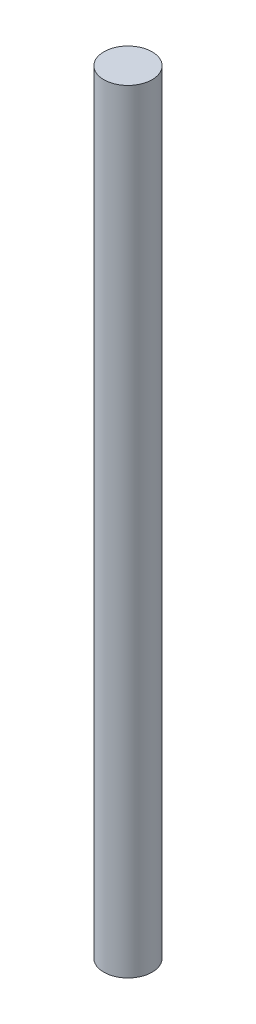
ISO-10303-21;
HEADER;
FILE_DESCRIPTION(('STEP AP214'),'2;1');
FILE_NAME('part.step','',(''),(''),'','','');
FILE_SCHEMA(('AUTOMOTIVE_DESIGN { 1 0 10303 214 1 1 1 1 }'));
ENDSEC;
DATA;
#1=APPLICATION_CONTEXT('core data for automotive mechanical design processes');
#2=APPLICATION_PROTOCOL_DEFINITION('international standard','automotive_design',2000,#1);
#3=PRODUCT_CONTEXT('',#1,'mechanical');
#4=PRODUCT('Part','Part','',(#3));
#5=PRODUCT_RELATED_PRODUCT_CATEGORY('part','',(#4));
#6=PRODUCT_DEFINITION_FORMATION('','',#4);
#7=PRODUCT_DEFINITION_CONTEXT('part definition',#1,'design');
#8=PRODUCT_DEFINITION('design','',#6,#7);
#9=PRODUCT_DEFINITION_SHAPE('','',#8);
#10=(LENGTH_UNIT() NAMED_UNIT(*) SI_UNIT(.MILLI.,.METRE.));
#11=(NAMED_UNIT(*) PLANE_ANGLE_UNIT() SI_UNIT($,.RADIAN.));
#12=(NAMED_UNIT(*) SI_UNIT($,.STERADIAN.) SOLID_ANGLE_UNIT());
#13=UNCERTAINTY_MEASURE_WITH_UNIT(LENGTH_MEASURE(1.E-05),#10,'distance_accuracy_value','');
#14=(GEOMETRIC_REPRESENTATION_CONTEXT(3) GLOBAL_UNCERTAINTY_ASSIGNED_CONTEXT((#13)) GLOBAL_UNIT_ASSIGNED_CONTEXT((#10,
#11,#12)) REPRESENTATION_CONTEXT('',''));
#15=CARTESIAN_POINT('',(0.,0.,0.));
#16=DIRECTION('',(0.,0.,1.));
#17=DIRECTION('',(1.,0.,0.));
#18=AXIS2_PLACEMENT_3D('',#15,#16,#17);
#19=CARTESIAN_POINT('',(0.,152.4,0.));
#20=DIRECTION('',(0.,-1.,0.));
#21=DIRECTION('',(0.,0.,-1.));
#22=AXIS2_PLACEMENT_3D('',#19,#20,#21);
#23=CYLINDRICAL_SURFACE('',#22,4.7625);
#24=CARTESIAN_POINT('',(0.,152.4,0.));
#25=DIRECTION('',(0.,1.,0.));
#26=DIRECTION('',(0.,0.,1.));
#27=AXIS2_PLACEMENT_3D('',#24,#25,#26);
#28=CIRCLE('',#27,4.7625);
#29=CARTESIAN_POINT('',(0.,152.4,4.7625));
#30=VERTEX_POINT('',#29);
#31=EDGE_CURVE('E10',#30,#30,#28,.T.);
#32=ORIENTED_EDGE('',*,*,#31,.F.);
#33=EDGE_LOOP('',(#32));
#34=FACE_BOUND('',#33,.T.);
#35=CARTESIAN_POINT('',(0.,0.,0.));
#36=DIRECTION('',(0.,1.,0.));
#37=DIRECTION('',(0.,0.,1.));
#38=AXIS2_PLACEMENT_3D('',#35,#36,#37);
#39=CIRCLE('',#38,4.7625);
#40=CARTESIAN_POINT('',(0.,0.,4.7625));
#41=VERTEX_POINT('',#40);
#42=EDGE_CURVE('E35',#41,#41,#39,.T.);
#43=ORIENTED_EDGE('',*,*,#42,.T.);
#44=EDGE_LOOP('',(#43));
#45=FACE_BOUND('',#44,.T.);
#46=ADVANCED_FACE('F32',(#34,#45),#23,.T.);
#47=CARTESIAN_POINT('',(0.,152.4,0.));
#48=DIRECTION('',(0.,1.,0.));
#49=DIRECTION('',(0.,0.,1.));
#50=AXIS2_PLACEMENT_3D('',#47,#48,#49);
#51=PLANE('',#50);
#52=ORIENTED_EDGE('',*,*,#31,.T.);
#53=EDGE_LOOP('',(#52));
#54=FACE_BOUND('',#53,.T.);
#55=ADVANCED_FACE('F47',(#54),#51,.T.);
#56=CARTESIAN_POINT('',(0.,0.,0.));
#57=DIRECTION('',(0.,1.,0.));
#58=DIRECTION('',(0.,0.,1.));
#59=AXIS2_PLACEMENT_3D('',#56,#57,#58);
#60=PLANE('',#59);
#61=ORIENTED_EDGE('',*,*,#42,.F.);
#62=EDGE_LOOP('',(#61));
#63=FACE_BOUND('',#62,.T.);
#64=ADVANCED_FACE('F45',(#63),#60,.F.);
#65=CLOSED_SHELL('',(#46,#55,#64));
#66=MANIFOLD_SOLID_BREP('B2',#65);
#67=ADVANCED_BREP_SHAPE_REPRESENTATION('',(#18,#66),#14);
#68=SHAPE_DEFINITION_REPRESENTATION(#9,#67);
ENDSEC;
END-ISO-10303-21;
